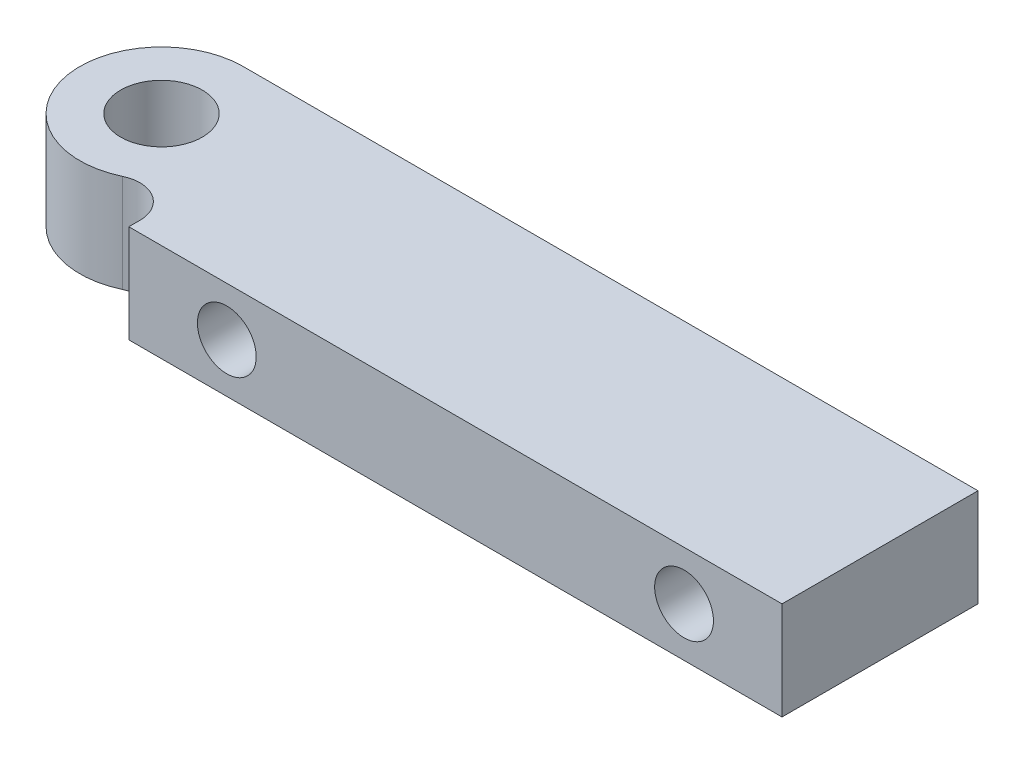
ISO-10303-21;
HEADER;
FILE_DESCRIPTION(('STEP AP214'),'2;1');
FILE_NAME('part.step','',(''),(''),'','','');
FILE_SCHEMA(('AUTOMOTIVE_DESIGN { 1 0 10303 214 1 1 1 1 }'));
ENDSEC;
DATA;
#1=APPLICATION_CONTEXT('core data for automotive mechanical design processes');
#2=APPLICATION_PROTOCOL_DEFINITION('international standard','automotive_design',2000,#1);
#3=PRODUCT_CONTEXT('',#1,'mechanical');
#4=PRODUCT('Part','Part','',(#3));
#5=PRODUCT_RELATED_PRODUCT_CATEGORY('part','',(#4));
#6=PRODUCT_DEFINITION_FORMATION('','',#4);
#7=PRODUCT_DEFINITION_CONTEXT('part definition',#1,'design');
#8=PRODUCT_DEFINITION('design','',#6,#7);
#9=PRODUCT_DEFINITION_SHAPE('','',#8);
#10=(LENGTH_UNIT() NAMED_UNIT(*) SI_UNIT(.MILLI.,.METRE.));
#11=(NAMED_UNIT(*) PLANE_ANGLE_UNIT() SI_UNIT($,.RADIAN.));
#12=(NAMED_UNIT(*) SI_UNIT($,.STERADIAN.) SOLID_ANGLE_UNIT());
#13=UNCERTAINTY_MEASURE_WITH_UNIT(LENGTH_MEASURE(1.E-05),#10,'distance_accuracy_value','');
#14=(GEOMETRIC_REPRESENTATION_CONTEXT(3) GLOBAL_UNCERTAINTY_ASSIGNED_CONTEXT((#13)) GLOBAL_UNIT_ASSIGNED_CONTEXT((#10,
#11,#12)) REPRESENTATION_CONTEXT('',''));
#15=CARTESIAN_POINT('',(0.,0.,0.));
#16=DIRECTION('',(0.,0.,1.));
#17=DIRECTION('',(1.,0.,0.));
#18=AXIS2_PLACEMENT_3D('',#15,#16,#17);
#19=CARTESIAN_POINT('',(0.,3.81,0.));
#20=DIRECTION('',(0.,1.,0.));
#21=DIRECTION('',(0.,0.,1.));
#22=AXIS2_PLACEMENT_3D('',#19,#20,#21);
#23=PLANE('',#22);
#24=DIRECTION('',(-1.,0.,0.));
#25=VECTOR('',#24,1.);
#26=CARTESIAN_POINT('',(12.3664598942496,3.81,-6.35));
#27=LINE('',#26,#25);
#28=CARTESIAN_POINT('',(57.15,3.81,-6.35));
#29=VERTEX_POINT('',#28);
#30=CARTESIAN_POINT('',(0.,3.81,-6.35));
#31=VERTEX_POINT('',#30);
#32=EDGE_CURVE('E89',#29,#31,#27,.T.);
#33=ORIENTED_EDGE('',*,*,#32,.T.);
#34=CARTESIAN_POINT('',(0.,3.81,0.));
#35=DIRECTION('',(0.,1.,0.));
#36=DIRECTION('',(0.,0.,1.));
#37=AXIS2_PLACEMENT_3D('',#34,#35,#36);
#38=CIRCLE('',#37,6.35);
#39=CARTESIAN_POINT('',(2.72142857142857,3.81,5.73727518344834));
#40=VERTEX_POINT('',#39);
#41=EDGE_CURVE('E92',#31,#40,#38,.T.);
#42=ORIENTED_EDGE('',*,*,#41,.T.);
#43=CARTESIAN_POINT('',(3.81,3.81,8.03218525682768));
#44=DIRECTION('',(0.,1.,0.));
#45=DIRECTION('',(0.,0.,1.));
#46=AXIS2_PLACEMENT_3D('',#43,#44,#45);
#47=CIRCLE('',#46,2.54);
#48=CARTESIAN_POINT('',(6.35,3.81,8.03218525682768));
#49=VERTEX_POINT('',#48);
#50=EDGE_CURVE('E11',#40,#49,#47,.F.);
#51=ORIENTED_EDGE('',*,*,#50,.T.);
#52=DIRECTION('',(0.,0.,1.));
#53=VECTOR('',#52,1.);
#54=CARTESIAN_POINT('',(6.35,3.81,0.));
#55=LINE('',#54,#53);
#56=CARTESIAN_POINT('',(6.35,3.81,8.89));
#57=VERTEX_POINT('',#56);
#58=EDGE_CURVE('E109',#49,#57,#55,.T.);
#59=ORIENTED_EDGE('',*,*,#58,.T.);
#60=DIRECTION('',(1.,0.,0.));
#61=VECTOR('',#60,1.);
#62=CARTESIAN_POINT('',(6.35,3.81,8.89));
#63=LINE('',#62,#61);
#64=CARTESIAN_POINT('',(57.15,3.81,8.89));
#65=VERTEX_POINT('',#64);
#66=EDGE_CURVE('E111',#57,#65,#63,.T.);
#67=ORIENTED_EDGE('',*,*,#66,.T.);
#68=DIRECTION('',(0.,0.,-1.));
#69=VECTOR('',#68,1.);
#70=CARTESIAN_POINT('',(57.15,3.81,-6.35));
#71=LINE('',#70,#69);
#72=EDGE_CURVE('E95',#65,#29,#71,.T.);
#73=ORIENTED_EDGE('',*,*,#72,.T.);
#74=EDGE_LOOP('',(#33,#42,#51,#59,#67,#73));
#75=FACE_BOUND('',#74,.T.);
#76=CARTESIAN_POINT('',(0.,3.81,0.));
#77=DIRECTION('',(0.,1.,0.));
#78=DIRECTION('',(0.,0.,1.));
#79=AXIS2_PLACEMENT_3D('',#76,#77,#78);
#80=CIRCLE('',#79,3.175);
#81=CARTESIAN_POINT('',(0.,3.81,3.175));
#82=VERTEX_POINT('',#81);
#83=EDGE_CURVE('E120',#82,#82,#80,.T.);
#84=ORIENTED_EDGE('',*,*,#83,.F.);
#85=EDGE_LOOP('',(#84));
#86=FACE_BOUND('',#85,.T.);
#87=ADVANCED_FACE('F37',(#75,#86),#23,.T.);
#88=CARTESIAN_POINT('',(0.,-3.81,0.));
#89=DIRECTION('',(0.,1.,0.));
#90=DIRECTION('',(0.,0.,1.));
#91=AXIS2_PLACEMENT_3D('',#88,#89,#90);
#92=PLANE('',#91);
#93=DIRECTION('',(-1.,0.,0.));
#94=VECTOR('',#93,1.);
#95=CARTESIAN_POINT('',(0.,-3.81,-6.35));
#96=LINE('',#95,#94);
#97=CARTESIAN_POINT('',(57.15,-3.81,-6.35));
#98=VERTEX_POINT('',#97);
#99=CARTESIAN_POINT('',(0.,-3.81,-6.35));
#100=VERTEX_POINT('',#99);
#101=EDGE_CURVE('E104',#98,#100,#96,.T.);
#102=ORIENTED_EDGE('',*,*,#101,.F.);
#103=DIRECTION('',(0.,0.,-1.));
#104=VECTOR('',#103,1.);
#105=CARTESIAN_POINT('',(57.15,-3.81,-6.35));
#106=LINE('',#105,#104);
#107=CARTESIAN_POINT('',(57.15,-3.81,8.89));
#108=VERTEX_POINT('',#107);
#109=EDGE_CURVE('E99',#108,#98,#106,.T.);
#110=ORIENTED_EDGE('',*,*,#109,.F.);
#111=DIRECTION('',(1.,0.,0.));
#112=VECTOR('',#111,1.);
#113=CARTESIAN_POINT('',(6.35,-3.81,8.89));
#114=LINE('',#113,#112);
#115=CARTESIAN_POINT('',(6.35,-3.81,8.89));
#116=VERTEX_POINT('',#115);
#117=EDGE_CURVE('E124',#116,#108,#114,.T.);
#118=ORIENTED_EDGE('',*,*,#117,.F.);
#119=DIRECTION('',(0.,0.,1.));
#120=VECTOR('',#119,1.);
#121=CARTESIAN_POINT('',(6.35,-3.81,0.));
#122=LINE('',#121,#120);
#123=CARTESIAN_POINT('',(6.35,-3.81,8.03218525682768));
#124=VERTEX_POINT('',#123);
#125=EDGE_CURVE('E122',#124,#116,#122,.T.);
#126=ORIENTED_EDGE('',*,*,#125,.F.);
#127=CARTESIAN_POINT('',(3.81,-3.81,8.03218525682768));
#128=DIRECTION('',(0.,1.,0.));
#129=DIRECTION('',(0.,0.,1.));
#130=AXIS2_PLACEMENT_3D('',#127,#128,#129);
#131=CIRCLE('',#130,2.54);
#132=CARTESIAN_POINT('',(2.72142857142857,-3.81,5.73727518344834));
#133=VERTEX_POINT('',#132);
#134=EDGE_CURVE('E45',#124,#133,#131,.T.);
#135=ORIENTED_EDGE('',*,*,#134,.T.);
#136=CARTESIAN_POINT('',(0.,-3.81,0.));
#137=DIRECTION('',(0.,1.,0.));
#138=DIRECTION('',(0.,0.,1.));
#139=AXIS2_PLACEMENT_3D('',#136,#137,#138);
#140=CIRCLE('',#139,6.35);
#141=EDGE_CURVE('E119',#100,#133,#140,.T.);
#142=ORIENTED_EDGE('',*,*,#141,.F.);
#143=EDGE_LOOP('',(#102,#110,#118,#126,#135,#142));
#144=FACE_BOUND('',#143,.T.);
#145=CARTESIAN_POINT('',(0.,-3.81,0.));
#146=DIRECTION('',(0.,1.,0.));
#147=DIRECTION('',(0.,0.,1.));
#148=AXIS2_PLACEMENT_3D('',#145,#146,#147);
#149=CIRCLE('',#148,3.175);
#150=CARTESIAN_POINT('',(0.,-3.81,3.175));
#151=VERTEX_POINT('',#150);
#152=EDGE_CURVE('E190',#151,#151,#149,.T.);
#153=ORIENTED_EDGE('',*,*,#152,.T.);
#154=EDGE_LOOP('',(#153));
#155=FACE_BOUND('',#154,.T.);
#156=ADVANCED_FACE('F143',(#144,#155),#92,.F.);
#157=CARTESIAN_POINT('',(0.,3.81,-6.35));
#158=DIRECTION('',(0.,0.,1.));
#159=DIRECTION('',(1.,0.,0.));
#160=AXIS2_PLACEMENT_3D('',#157,#158,#159);
#161=PLANE('',#160);
#162=ORIENTED_EDGE('',*,*,#101,.T.);
#163=DIRECTION('',(0.,-1.,0.));
#164=VECTOR('',#163,1.);
#165=CARTESIAN_POINT('',(0.,3.81,-6.35));
#166=LINE('',#165,#164);
#167=EDGE_CURVE('E102',#31,#100,#166,.T.);
#168=ORIENTED_EDGE('',*,*,#167,.F.);
#169=ORIENTED_EDGE('',*,*,#32,.F.);
#170=DIRECTION('',(0.,-1.,0.));
#171=VECTOR('',#170,1.);
#172=CARTESIAN_POINT('',(57.15,3.81,-6.35));
#173=LINE('',#172,#171);
#174=EDGE_CURVE('E117',#29,#98,#173,.T.);
#175=ORIENTED_EDGE('',*,*,#174,.T.);
#176=EDGE_LOOP('',(#162,#168,#169,#175));
#177=FACE_BOUND('',#176,.T.);
#178=ADVANCED_FACE('F103',(#177),#161,.F.);
#179=CARTESIAN_POINT('',(0.,3.81,0.));
#180=DIRECTION('',(0.,-1.,0.));
#181=DIRECTION('',(0.,0.,-1.));
#182=AXIS2_PLACEMENT_3D('',#179,#180,#181);
#183=CYLINDRICAL_SURFACE('',#182,6.35);
#184=ORIENTED_EDGE('',*,*,#141,.T.);
#185=DIRECTION('',(0.,-1.,0.));
#186=VECTOR('',#185,1.);
#187=CARTESIAN_POINT('',(2.72142857142857,3.81,5.73727518344834));
#188=LINE('',#187,#186);
#189=EDGE_CURVE('E52',#133,#40,#188,.F.);
#190=ORIENTED_EDGE('',*,*,#189,.T.);
#191=ORIENTED_EDGE('',*,*,#41,.F.);
#192=ORIENTED_EDGE('',*,*,#167,.T.);
#193=EDGE_LOOP('',(#184,#190,#191,#192));
#194=FACE_BOUND('',#193,.T.);
#195=ADVANCED_FACE('F108',(#194),#183,.T.);
#196=CARTESIAN_POINT('',(6.35,3.81,0.));
#197=DIRECTION('',(1.,0.,0.));
#198=DIRECTION('',(0.,0.,-1.));
#199=AXIS2_PLACEMENT_3D('',#196,#197,#198);
#200=PLANE('',#199);
#201=ORIENTED_EDGE('',*,*,#58,.F.);
#202=DIRECTION('',(0.,1.,0.));
#203=VECTOR('',#202,1.);
#204=CARTESIAN_POINT('',(6.35,-3.81,8.03218525682768));
#205=LINE('',#204,#203);
#206=EDGE_CURVE('E105',#49,#124,#205,.F.);
#207=ORIENTED_EDGE('',*,*,#206,.T.);
#208=ORIENTED_EDGE('',*,*,#125,.T.);
#209=DIRECTION('',(0.,-1.,0.));
#210=VECTOR('',#209,1.);
#211=CARTESIAN_POINT('',(6.35,3.81,8.89));
#212=LINE('',#211,#210);
#213=EDGE_CURVE('E106',#57,#116,#212,.T.);
#214=ORIENTED_EDGE('',*,*,#213,.F.);
#215=EDGE_LOOP('',(#201,#207,#208,#214));
#216=FACE_BOUND('',#215,.T.);
#217=ADVANCED_FACE('F139',(#216),#200,.F.);
#218=CARTESIAN_POINT('',(6.35,3.81,8.89));
#219=DIRECTION('',(0.,0.,-1.));
#220=DIRECTION('',(-1.,0.,0.));
#221=AXIS2_PLACEMENT_3D('',#218,#219,#220);
#222=PLANE('',#221);
#223=CARTESIAN_POINT('',(13.9700000000023,0.,8.89));
#224=DIRECTION('',(0.,0.,1.));
#225=DIRECTION('',(1.,0.,0.));
#226=AXIS2_PLACEMENT_3D('',#223,#224,#225);
#227=CIRCLE('',#226,2.28599999999788);
#228=CARTESIAN_POINT('',(16.2560000000002,0.,8.89));
#229=VERTEX_POINT('',#228);
#230=EDGE_CURVE('E191',#229,#229,#227,.T.);
#231=ORIENTED_EDGE('',*,*,#230,.F.);
#232=EDGE_LOOP('',(#231));
#233=FACE_BOUND('',#232,.T.);
#234=CARTESIAN_POINT('',(49.5300000000024,0.,8.89));
#235=DIRECTION('',(0.,0.,1.));
#236=DIRECTION('',(1.,0.,0.));
#237=AXIS2_PLACEMENT_3D('',#234,#235,#236);
#238=CIRCLE('',#237,2.28599999999788);
#239=CARTESIAN_POINT('',(51.8160000000002,0.,8.89));
#240=VERTEX_POINT('',#239);
#241=EDGE_CURVE('E200',#240,#240,#238,.T.);
#242=ORIENTED_EDGE('',*,*,#241,.F.);
#243=EDGE_LOOP('',(#242));
#244=FACE_BOUND('',#243,.T.);
#245=ORIENTED_EDGE('',*,*,#117,.T.);
#246=DIRECTION('',(0.,-1.,0.));
#247=VECTOR('',#246,1.);
#248=CARTESIAN_POINT('',(57.15,3.81,8.89));
#249=LINE('',#248,#247);
#250=EDGE_CURVE('E129',#65,#108,#249,.T.);
#251=ORIENTED_EDGE('',*,*,#250,.F.);
#252=ORIENTED_EDGE('',*,*,#66,.F.);
#253=ORIENTED_EDGE('',*,*,#213,.T.);
#254=EDGE_LOOP('',(#245,#251,#252,#253));
#255=FACE_BOUND('',#254,.T.);
#256=ADVANCED_FACE('F148',(#233,#244,#255),#222,.F.);
#257=CARTESIAN_POINT('',(57.15,3.81,-6.35));
#258=DIRECTION('',(-1.,0.,0.));
#259=DIRECTION('',(0.,0.,1.));
#260=AXIS2_PLACEMENT_3D('',#257,#258,#259);
#261=PLANE('',#260);
#262=ORIENTED_EDGE('',*,*,#109,.T.);
#263=ORIENTED_EDGE('',*,*,#174,.F.);
#264=ORIENTED_EDGE('',*,*,#72,.F.);
#265=ORIENTED_EDGE('',*,*,#250,.T.);
#266=EDGE_LOOP('',(#262,#263,#264,#265));
#267=FACE_BOUND('',#266,.T.);
#268=ADVANCED_FACE('F151',(#267),#261,.F.);
#269=CARTESIAN_POINT('',(0.,3.81,0.));
#270=DIRECTION('',(0.,-1.,0.));
#271=DIRECTION('',(0.,0.,-1.));
#272=AXIS2_PLACEMENT_3D('',#269,#270,#271);
#273=CYLINDRICAL_SURFACE('',#272,3.175);
#274=ORIENTED_EDGE('',*,*,#83,.T.);
#275=EDGE_LOOP('',(#274));
#276=FACE_BOUND('',#275,.T.);
#277=ORIENTED_EDGE('',*,*,#152,.F.);
#278=EDGE_LOOP('',(#277));
#279=FACE_BOUND('',#278,.T.);
#280=ADVANCED_FACE('F153',(#276,#279),#273,.F.);
#281=CARTESIAN_POINT('',(3.81,3.81,8.03218525682768));
#282=DIRECTION('',(0.,-1.,0.));
#283=DIRECTION('',(0.,0.,-1.));
#284=AXIS2_PLACEMENT_3D('',#281,#282,#283);
#285=CYLINDRICAL_SURFACE('',#284,2.54);
#286=ORIENTED_EDGE('',*,*,#50,.F.);
#287=ORIENTED_EDGE('',*,*,#189,.F.);
#288=ORIENTED_EDGE('',*,*,#134,.F.);
#289=ORIENTED_EDGE('',*,*,#206,.F.);
#290=EDGE_LOOP('',(#286,#287,#288,#289));
#291=FACE_BOUND('',#290,.T.);
#292=ADVANCED_FACE('F39',(#291),#285,.F.);
#293=CARTESIAN_POINT('',(49.5300000000024,0.,3.81));
#294=DIRECTION('',(0.,0.,1.));
#295=DIRECTION('',(1.,0.,0.));
#296=AXIS2_PLACEMENT_3D('',#293,#294,#295);
#297=CYLINDRICAL_SURFACE('',#296,2.28599999999788);
#298=CARTESIAN_POINT('',(49.5300000000024,0.,3.81));
#299=DIRECTION('',(0.,0.,1.));
#300=DIRECTION('',(1.,0.,0.));
#301=AXIS2_PLACEMENT_3D('',#298,#299,#300);
#302=CIRCLE('',#301,2.28599999999788);
#303=CARTESIAN_POINT('',(51.8160000000002,0.,3.81));
#304=VERTEX_POINT('',#303);
#305=EDGE_CURVE('E195',#304,#304,#302,.T.);
#306=ORIENTED_EDGE('',*,*,#305,.F.);
#307=EDGE_LOOP('',(#306));
#308=FACE_BOUND('',#307,.T.);
#309=ORIENTED_EDGE('',*,*,#241,.T.);
#310=EDGE_LOOP('',(#309));
#311=FACE_BOUND('',#310,.T.);
#312=ADVANCED_FACE('F170',(#308,#311),#297,.F.);
#313=CARTESIAN_POINT('',(0.,0.,3.81));
#314=DIRECTION('',(0.,0.,1.));
#315=DIRECTION('',(1.,0.,0.));
#316=AXIS2_PLACEMENT_3D('',#313,#314,#315);
#317=PLANE('',#316);
#318=ORIENTED_EDGE('',*,*,#305,.T.);
#319=EDGE_LOOP('',(#318));
#320=FACE_BOUND('',#319,.T.);
#321=ADVANCED_FACE('F173',(#320),#317,.T.);
#322=CARTESIAN_POINT('',(13.9700000000023,0.,3.81));
#323=DIRECTION('',(0.,0.,1.));
#324=DIRECTION('',(1.,0.,0.));
#325=AXIS2_PLACEMENT_3D('',#322,#323,#324);
#326=CYLINDRICAL_SURFACE('',#325,2.28599999999788);
#327=CARTESIAN_POINT('',(13.9700000000023,0.,3.81));
#328=DIRECTION('',(0.,0.,1.));
#329=DIRECTION('',(1.,0.,0.));
#330=AXIS2_PLACEMENT_3D('',#327,#328,#329);
#331=CIRCLE('',#330,2.28599999999788);
#332=CARTESIAN_POINT('',(16.2560000000002,0.,3.81));
#333=VERTEX_POINT('',#332);
#334=EDGE_CURVE('E189',#333,#333,#331,.T.);
#335=ORIENTED_EDGE('',*,*,#334,.F.);
#336=EDGE_LOOP('',(#335));
#337=FACE_BOUND('',#336,.T.);
#338=ORIENTED_EDGE('',*,*,#230,.T.);
#339=EDGE_LOOP('',(#338));
#340=FACE_BOUND('',#339,.T.);
#341=ADVANCED_FACE('F177',(#337,#340),#326,.F.);
#342=CARTESIAN_POINT('',(0.,0.,3.81));
#343=DIRECTION('',(0.,0.,1.));
#344=DIRECTION('',(1.,0.,0.));
#345=AXIS2_PLACEMENT_3D('',#342,#343,#344);
#346=PLANE('',#345);
#347=ORIENTED_EDGE('',*,*,#334,.T.);
#348=EDGE_LOOP('',(#347));
#349=FACE_BOUND('',#348,.T.);
#350=ADVANCED_FACE('F181',(#349),#346,.T.);
#351=CLOSED_SHELL('',(#87,#156,#178,#195,#217,#256,#268,#280,#292,#312,#321,#341,#350));
#352=MANIFOLD_SOLID_BREP('B2',#351);
#353=ADVANCED_BREP_SHAPE_REPRESENTATION('',(#18,#352),#14);
#354=SHAPE_DEFINITION_REPRESENTATION(#9,#353);
ENDSEC;
END-ISO-10303-21;
